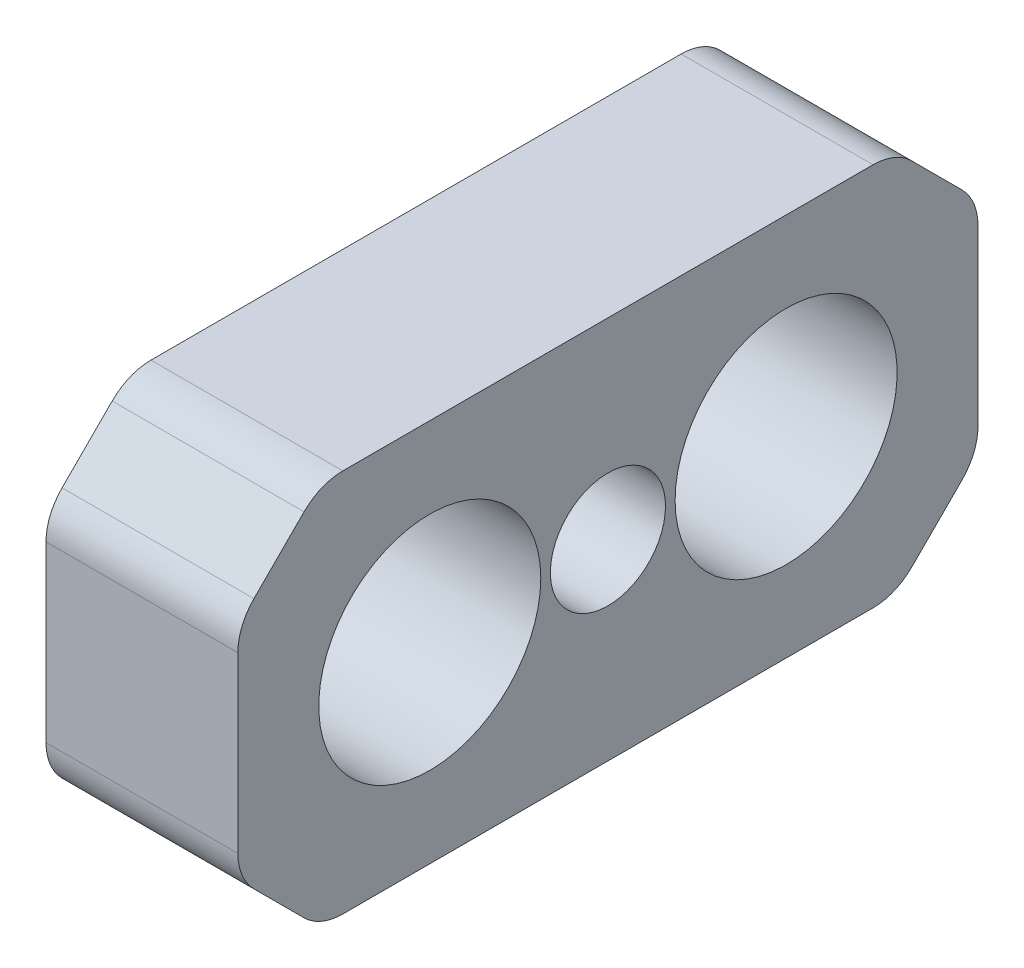
ISO-10303-21;
HEADER;
FILE_DESCRIPTION(('STEP AP214'),'2;1');
FILE_NAME('part.step','',(''),(''),'','','');
FILE_SCHEMA(('AUTOMOTIVE_DESIGN { 1 0 10303 214 1 1 1 1 }'));
ENDSEC;
DATA;
#1=APPLICATION_CONTEXT('core data for automotive mechanical design processes');
#2=APPLICATION_PROTOCOL_DEFINITION('international standard','automotive_design',2000,#1);
#3=PRODUCT_CONTEXT('',#1,'mechanical');
#4=PRODUCT('Part','Part','',(#3));
#5=PRODUCT_RELATED_PRODUCT_CATEGORY('part','',(#4));
#6=PRODUCT_DEFINITION_FORMATION('','',#4);
#7=PRODUCT_DEFINITION_CONTEXT('part definition',#1,'design');
#8=PRODUCT_DEFINITION('design','',#6,#7);
#9=PRODUCT_DEFINITION_SHAPE('','',#8);
#10=(LENGTH_UNIT() NAMED_UNIT(*) SI_UNIT(.MILLI.,.METRE.));
#11=(NAMED_UNIT(*) PLANE_ANGLE_UNIT() SI_UNIT($,.RADIAN.));
#12=(NAMED_UNIT(*) SI_UNIT($,.STERADIAN.) SOLID_ANGLE_UNIT());
#13=UNCERTAINTY_MEASURE_WITH_UNIT(LENGTH_MEASURE(1.E-05),#10,'distance_accuracy_value','');
#14=(GEOMETRIC_REPRESENTATION_CONTEXT(3) GLOBAL_UNCERTAINTY_ASSIGNED_CONTEXT((#13)) GLOBAL_UNIT_ASSIGNED_CONTEXT((#10,
#11,#12)) REPRESENTATION_CONTEXT('',''));
#15=CARTESIAN_POINT('',(0.,0.,0.));
#16=DIRECTION('',(0.,0.,1.));
#17=DIRECTION('',(1.,0.,0.));
#18=AXIS2_PLACEMENT_3D('',#15,#16,#17);
#19=CARTESIAN_POINT('',(7.,7.,13.5));
#20=DIRECTION('',(1.,0.,0.));
#21=DIRECTION('',(0.,0.,-1.));
#22=AXIS2_PLACEMENT_3D('',#19,#20,#21);
#23=PLANE('',#22);
#24=CARTESIAN_POINT('',(7.,0.,0.));
#25=DIRECTION('',(1.,0.,0.));
#26=DIRECTION('',(0.,0.,-1.));
#27=AXIS2_PLACEMENT_3D('',#24,#25,#26);
#28=CIRCLE('',#27,2.1);
#29=CARTESIAN_POINT('',(7.,0.,-2.1));
#30=VERTEX_POINT('',#29);
#31=EDGE_CURVE('E314',#30,#30,#28,.T.);
#32=ORIENTED_EDGE('',*,*,#31,.F.);
#33=EDGE_LOOP('',(#32));
#34=FACE_BOUND('',#33,.T.);
#35=CARTESIAN_POINT('',(7.,0.,6.5));
#36=DIRECTION('',(1.,0.,0.));
#37=DIRECTION('',(0.,0.,-1.));
#38=AXIS2_PLACEMENT_3D('',#35,#36,#37);
#39=CIRCLE('',#38,4.05);
#40=CARTESIAN_POINT('',(7.,0.,2.45));
#41=VERTEX_POINT('',#40);
#42=EDGE_CURVE('E272',#41,#41,#39,.T.);
#43=ORIENTED_EDGE('',*,*,#42,.F.);
#44=EDGE_LOOP('',(#43));
#45=FACE_BOUND('',#44,.T.);
#46=DIRECTION('',(0.,1.,0.));
#47=VECTOR('',#46,1.);
#48=CARTESIAN_POINT('',(7.,-7.,-13.5));
#49=LINE('',#48,#47);
#50=CARTESIAN_POINT('',(7.,-3.17157287525381,-13.5));
#51=VERTEX_POINT('',#50);
#52=CARTESIAN_POINT('',(7.,3.17157287525381,-13.5));
#53=VERTEX_POINT('',#52);
#54=EDGE_CURVE('E149',#51,#53,#49,.T.);
#55=ORIENTED_EDGE('',*,*,#54,.T.);
#56=CARTESIAN_POINT('',(7.,3.17157287525381,-11.5));
#57=DIRECTION('',(1.,0.,0.));
#58=DIRECTION('',(0.,0.,-1.));
#59=AXIS2_PLACEMENT_3D('',#56,#57,#58);
#60=CIRCLE('',#59,2.);
#61=CARTESIAN_POINT('',(7.,4.58578643762689,-12.9142135623731));
#62=VERTEX_POINT('',#61);
#63=EDGE_CURVE('E190',#53,#62,#60,.T.);
#64=ORIENTED_EDGE('',*,*,#63,.T.);
#65=DIRECTION('',(0.,-0.707106781186549,-0.707106781186546));
#66=VECTOR('',#65,1.);
#67=CARTESIAN_POINT('',(7.,19.,1.49999999999995));
#68=LINE('',#67,#66);
#69=CARTESIAN_POINT('',(7.,6.41421356237309,-11.0857864376269));
#70=VERTEX_POINT('',#69);
#71=EDGE_CURVE('E250',#62,#70,#68,.F.);
#72=ORIENTED_EDGE('',*,*,#71,.T.);
#73=CARTESIAN_POINT('',(7.,5.,-9.67157287525381));
#74=DIRECTION('',(1.,0.,0.));
#75=DIRECTION('',(0.,0.,-1.));
#76=AXIS2_PLACEMENT_3D('',#73,#74,#75);
#77=CIRCLE('',#76,2.);
#78=CARTESIAN_POINT('',(7.,7.,-9.67157287525381));
#79=VERTEX_POINT('',#78);
#80=EDGE_CURVE('E155',#70,#79,#77,.T.);
#81=ORIENTED_EDGE('',*,*,#80,.T.);
#82=DIRECTION('',(0.,0.,1.));
#83=VECTOR('',#82,1.);
#84=CARTESIAN_POINT('',(7.,7.,-13.5));
#85=LINE('',#84,#83);
#86=CARTESIAN_POINT('',(7.,7.,9.6715728752538));
#87=VERTEX_POINT('',#86);
#88=EDGE_CURVE('E167',#79,#87,#85,.T.);
#89=ORIENTED_EDGE('',*,*,#88,.T.);
#90=CARTESIAN_POINT('',(7.,5.,9.6715728752538));
#91=DIRECTION('',(1.,0.,0.));
#92=DIRECTION('',(0.,0.,-1.));
#93=AXIS2_PLACEMENT_3D('',#90,#91,#92);
#94=CIRCLE('',#93,2.);
#95=CARTESIAN_POINT('',(7.,6.41421356237309,11.0857864376269));
#96=VERTEX_POINT('',#95);
#97=EDGE_CURVE('E174',#87,#96,#94,.T.);
#98=ORIENTED_EDGE('',*,*,#97,.T.);
#99=DIRECTION('',(0.,0.707106781186546,-0.707106781186549));
#100=VECTOR('',#99,1.);
#101=CARTESIAN_POINT('',(7.,5.49999999999999,12.));
#102=LINE('',#101,#100);
#103=CARTESIAN_POINT('',(7.,4.5857864376269,12.9142135623731));
#104=VERTEX_POINT('',#103);
#105=EDGE_CURVE('E172',#96,#104,#102,.F.);
#106=ORIENTED_EDGE('',*,*,#105,.T.);
#107=CARTESIAN_POINT('',(7.,3.17157287525381,11.5));
#108=DIRECTION('',(1.,0.,0.));
#109=DIRECTION('',(0.,0.,-1.));
#110=AXIS2_PLACEMENT_3D('',#107,#108,#109);
#111=CIRCLE('',#110,2.);
#112=CARTESIAN_POINT('',(7.,3.17157287525381,13.5));
#113=VERTEX_POINT('',#112);
#114=EDGE_CURVE('E182',#104,#113,#111,.T.);
#115=ORIENTED_EDGE('',*,*,#114,.T.);
#116=DIRECTION('',(0.,-1.,0.));
#117=VECTOR('',#116,1.);
#118=CARTESIAN_POINT('',(7.,-7.,13.5));
#119=LINE('',#118,#117);
#120=CARTESIAN_POINT('',(7.,-3.17157287525381,13.5));
#121=VERTEX_POINT('',#120);
#122=EDGE_CURVE('E277',#113,#121,#119,.T.);
#123=ORIENTED_EDGE('',*,*,#122,.T.);
#124=CARTESIAN_POINT('',(7.,-3.17157287525381,11.5));
#125=DIRECTION('',(1.,0.,0.));
#126=DIRECTION('',(0.,0.,-1.));
#127=AXIS2_PLACEMENT_3D('',#124,#125,#126);
#128=CIRCLE('',#127,2.);
#129=CARTESIAN_POINT('',(7.,-4.58578643762691,12.9142135623731));
#130=VERTEX_POINT('',#129);
#131=EDGE_CURVE('E184',#121,#130,#128,.T.);
#132=ORIENTED_EDGE('',*,*,#131,.T.);
#133=DIRECTION('',(0.,0.707106781186549,0.707106781186546));
#134=VECTOR('',#133,1.);
#135=CARTESIAN_POINT('',(7.,1.50000000000002,19.));
#136=LINE('',#135,#134);
#137=CARTESIAN_POINT('',(7.,-6.41421356237309,11.0857864376269));
#138=VERTEX_POINT('',#137);
#139=EDGE_CURVE('E177',#130,#138,#136,.F.);
#140=ORIENTED_EDGE('',*,*,#139,.T.);
#141=CARTESIAN_POINT('',(7.,-5.,9.67157287525382));
#142=DIRECTION('',(1.,0.,0.));
#143=DIRECTION('',(0.,0.,-1.));
#144=AXIS2_PLACEMENT_3D('',#141,#142,#143);
#145=CIRCLE('',#144,2.);
#146=CARTESIAN_POINT('',(7.,-7.,9.67157287525382));
#147=VERTEX_POINT('',#146);
#148=EDGE_CURVE('E186',#138,#147,#145,.T.);
#149=ORIENTED_EDGE('',*,*,#148,.T.);
#150=DIRECTION('',(0.,0.,-1.));
#151=VECTOR('',#150,1.);
#152=CARTESIAN_POINT('',(7.,-7.,-13.5));
#153=LINE('',#152,#151);
#154=CARTESIAN_POINT('',(7.,-7.,-9.6715728752538));
#155=VERTEX_POINT('',#154);
#156=EDGE_CURVE('E168',#147,#155,#153,.T.);
#157=ORIENTED_EDGE('',*,*,#156,.T.);
#158=CARTESIAN_POINT('',(7.,-5.,-9.6715728752538));
#159=DIRECTION('',(1.,0.,0.));
#160=DIRECTION('',(0.,0.,-1.));
#161=AXIS2_PLACEMENT_3D('',#158,#159,#160);
#162=CIRCLE('',#161,2.);
#163=CARTESIAN_POINT('',(7.,-6.4142135623731,-11.0857864376269));
#164=VERTEX_POINT('',#163);
#165=EDGE_CURVE('E156',#155,#164,#162,.T.);
#166=ORIENTED_EDGE('',*,*,#165,.T.);
#167=DIRECTION('',(0.,-0.707106781186546,0.707106781186549));
#168=VECTOR('',#167,1.);
#169=CARTESIAN_POINT('',(7.,-12.,-5.49999999999995));
#170=LINE('',#169,#168);
#171=CARTESIAN_POINT('',(7.,-4.5857864376269,-12.9142135623731));
#172=VERTEX_POINT('',#171);
#173=EDGE_CURVE('E151',#164,#172,#170,.F.);
#174=ORIENTED_EDGE('',*,*,#173,.T.);
#175=CARTESIAN_POINT('',(7.,-3.17157287525381,-11.5));
#176=DIRECTION('',(1.,0.,0.));
#177=DIRECTION('',(0.,0.,-1.));
#178=AXIS2_PLACEMENT_3D('',#175,#176,#177);
#179=CIRCLE('',#178,2.);
#180=EDGE_CURVE('E146',#172,#51,#179,.T.);
#181=ORIENTED_EDGE('',*,*,#180,.T.);
#182=EDGE_LOOP('',(#55,#64,#72,#81,#89,#98,#106,#115,#123,#132,#140,#149,#157,#166,#174,#181));
#183=FACE_BOUND('',#182,.T.);
#184=CARTESIAN_POINT('',(7.,0.,-6.5));
#185=DIRECTION('',(1.,0.,0.));
#186=DIRECTION('',(0.,0.,1.));
#187=AXIS2_PLACEMENT_3D('',#184,#185,#186);
#188=CIRCLE('',#187,4.05);
#189=CARTESIAN_POINT('',(7.,0.,-2.45));
#190=VERTEX_POINT('',#189);
#191=EDGE_CURVE('E305',#190,#190,#188,.T.);
#192=ORIENTED_EDGE('',*,*,#191,.F.);
#193=EDGE_LOOP('',(#192));
#194=FACE_BOUND('',#193,.T.);
#195=ADVANCED_FACE('F32',(#34,#45,#183,#194),#23,.T.);
#196=CARTESIAN_POINT('',(0.,7.,13.5));
#197=DIRECTION('',(1.,0.,0.));
#198=DIRECTION('',(0.,0.,-1.));
#199=AXIS2_PLACEMENT_3D('',#196,#197,#198);
#200=PLANE('',#199);
#201=CARTESIAN_POINT('',(0.,0.,6.5));
#202=DIRECTION('',(1.,0.,0.));
#203=DIRECTION('',(0.,0.,-1.));
#204=AXIS2_PLACEMENT_3D('',#201,#202,#203);
#205=CIRCLE('',#204,4.05);
#206=CARTESIAN_POINT('',(0.,0.,2.45));
#207=VERTEX_POINT('',#206);
#208=EDGE_CURVE('E302',#207,#207,#205,.T.);
#209=ORIENTED_EDGE('',*,*,#208,.T.);
#210=EDGE_LOOP('',(#209));
#211=FACE_BOUND('',#210,.T.);
#212=DIRECTION('',(0.,0.707106781186549,0.707106781186546));
#213=VECTOR('',#212,1.);
#214=CARTESIAN_POINT('',(0.,7.,-10.5));
#215=LINE('',#214,#213);
#216=CARTESIAN_POINT('',(0.,6.41421356237309,-11.0857864376269));
#217=VERTEX_POINT('',#216);
#218=CARTESIAN_POINT('',(0.,4.5857864376269,-12.9142135623731));
#219=VERTEX_POINT('',#218);
#220=EDGE_CURVE('E262',#217,#219,#215,.F.);
#221=ORIENTED_EDGE('',*,*,#220,.T.);
#222=CARTESIAN_POINT('',(0.,3.17157287525381,-11.5));
#223=DIRECTION('',(1.,0.,0.));
#224=DIRECTION('',(0.,0.,-1.));
#225=AXIS2_PLACEMENT_3D('',#222,#223,#224);
#226=CIRCLE('',#225,2.);
#227=CARTESIAN_POINT('',(0.,3.17157287525381,-13.5));
#228=VERTEX_POINT('',#227);
#229=EDGE_CURVE('E208',#219,#228,#226,.F.);
#230=ORIENTED_EDGE('',*,*,#229,.T.);
#231=DIRECTION('',(0.,1.,0.));
#232=VECTOR('',#231,1.);
#233=CARTESIAN_POINT('',(0.,-7.,-13.5));
#234=LINE('',#233,#232);
#235=CARTESIAN_POINT('',(0.,-3.17157287525381,-13.5));
#236=VERTEX_POINT('',#235);
#237=EDGE_CURVE('E275',#236,#228,#234,.T.);
#238=ORIENTED_EDGE('',*,*,#237,.F.);
#239=CARTESIAN_POINT('',(0.,-3.17157287525381,-11.5));
#240=DIRECTION('',(1.,0.,0.));
#241=DIRECTION('',(0.,0.,-1.));
#242=AXIS2_PLACEMENT_3D('',#239,#240,#241);
#243=CIRCLE('',#242,2.);
#244=CARTESIAN_POINT('',(0.,-4.5857864376269,-12.9142135623731));
#245=VERTEX_POINT('',#244);
#246=EDGE_CURVE('E171',#236,#245,#243,.F.);
#247=ORIENTED_EDGE('',*,*,#246,.T.);
#248=DIRECTION('',(0.,0.707106781186546,-0.707106781186549));
#249=VECTOR('',#248,1.);
#250=CARTESIAN_POINT('',(0.,-4.,-13.5));
#251=LINE('',#250,#249);
#252=CARTESIAN_POINT('',(0.,-6.4142135623731,-11.0857864376269));
#253=VERTEX_POINT('',#252);
#254=EDGE_CURVE('E264',#245,#253,#251,.F.);
#255=ORIENTED_EDGE('',*,*,#254,.T.);
#256=CARTESIAN_POINT('',(0.,-5.,-9.6715728752538));
#257=DIRECTION('',(1.,0.,0.));
#258=DIRECTION('',(0.,0.,-1.));
#259=AXIS2_PLACEMENT_3D('',#256,#257,#258);
#260=CIRCLE('',#259,2.);
#261=CARTESIAN_POINT('',(0.,-7.,-9.6715728752538));
#262=VERTEX_POINT('',#261);
#263=EDGE_CURVE('E203',#253,#262,#260,.F.);
#264=ORIENTED_EDGE('',*,*,#263,.T.);
#265=DIRECTION('',(0.,0.,-1.));
#266=VECTOR('',#265,1.);
#267=CARTESIAN_POINT('',(0.,-7.,-13.5));
#268=LINE('',#267,#266);
#269=CARTESIAN_POINT('',(0.,-7.,9.67157287525382));
#270=VERTEX_POINT('',#269);
#271=EDGE_CURVE('E271',#270,#262,#268,.T.);
#272=ORIENTED_EDGE('',*,*,#271,.F.);
#273=CARTESIAN_POINT('',(0.,-5.,9.67157287525382));
#274=DIRECTION('',(1.,0.,0.));
#275=DIRECTION('',(0.,0.,-1.));
#276=AXIS2_PLACEMENT_3D('',#273,#274,#275);
#277=CIRCLE('',#276,2.);
#278=CARTESIAN_POINT('',(0.,-6.41421356237309,11.0857864376269));
#279=VERTEX_POINT('',#278);
#280=EDGE_CURVE('E54',#270,#279,#277,.F.);
#281=ORIENTED_EDGE('',*,*,#280,.T.);
#282=DIRECTION('',(0.,-0.707106781186549,-0.707106781186546));
#283=VECTOR('',#282,1.);
#284=CARTESIAN_POINT('',(0.,-7.,10.5));
#285=LINE('',#284,#283);
#286=CARTESIAN_POINT('',(0.,-4.5857864376269,12.9142135623731));
#287=VERTEX_POINT('',#286);
#288=EDGE_CURVE('E251',#279,#287,#285,.F.);
#289=ORIENTED_EDGE('',*,*,#288,.T.);
#290=CARTESIAN_POINT('',(0.,-3.17157287525381,11.5));
#291=DIRECTION('',(1.,0.,0.));
#292=DIRECTION('',(0.,0.,-1.));
#293=AXIS2_PLACEMENT_3D('',#290,#291,#292);
#294=CIRCLE('',#293,2.);
#295=CARTESIAN_POINT('',(0.,-3.17157287525381,13.5));
#296=VERTEX_POINT('',#295);
#297=EDGE_CURVE('E200',#287,#296,#294,.F.);
#298=ORIENTED_EDGE('',*,*,#297,.T.);
#299=DIRECTION('',(0.,-1.,0.));
#300=VECTOR('',#299,1.);
#301=CARTESIAN_POINT('',(0.,-7.,13.5));
#302=LINE('',#301,#300);
#303=CARTESIAN_POINT('',(0.,3.17157287525381,13.5));
#304=VERTEX_POINT('',#303);
#305=EDGE_CURVE('E268',#304,#296,#302,.T.);
#306=ORIENTED_EDGE('',*,*,#305,.F.);
#307=CARTESIAN_POINT('',(0.,3.17157287525381,11.5));
#308=DIRECTION('',(1.,0.,0.));
#309=DIRECTION('',(0.,0.,-1.));
#310=AXIS2_PLACEMENT_3D('',#307,#308,#309);
#311=CIRCLE('',#310,2.);
#312=CARTESIAN_POINT('',(0.,4.5857864376269,12.9142135623731));
#313=VERTEX_POINT('',#312);
#314=EDGE_CURVE('E198',#304,#313,#311,.F.);
#315=ORIENTED_EDGE('',*,*,#314,.T.);
#316=DIRECTION('',(0.,-0.707106781186546,0.707106781186549));
#317=VECTOR('',#316,1.);
#318=CARTESIAN_POINT('',(0.,4.,13.5));
#319=LINE('',#318,#317);
#320=CARTESIAN_POINT('',(0.,6.41421356237309,11.0857864376269));
#321=VERTEX_POINT('',#320);
#322=EDGE_CURVE('E240',#313,#321,#319,.F.);
#323=ORIENTED_EDGE('',*,*,#322,.T.);
#324=CARTESIAN_POINT('',(0.,5.,9.6715728752538));
#325=DIRECTION('',(1.,0.,0.));
#326=DIRECTION('',(0.,0.,-1.));
#327=AXIS2_PLACEMENT_3D('',#324,#325,#326);
#328=CIRCLE('',#327,2.);
#329=CARTESIAN_POINT('',(0.,7.,9.6715728752538));
#330=VERTEX_POINT('',#329);
#331=EDGE_CURVE('E196',#321,#330,#328,.F.);
#332=ORIENTED_EDGE('',*,*,#331,.T.);
#333=DIRECTION('',(0.,0.,1.));
#334=VECTOR('',#333,1.);
#335=CARTESIAN_POINT('',(0.,7.,-13.5));
#336=LINE('',#335,#334);
#337=CARTESIAN_POINT('',(0.,7.,-9.67157287525381));
#338=VERTEX_POINT('',#337);
#339=EDGE_CURVE('E259',#338,#330,#336,.T.);
#340=ORIENTED_EDGE('',*,*,#339,.F.);
#341=CARTESIAN_POINT('',(0.,5.,-9.67157287525381));
#342=DIRECTION('',(1.,0.,0.));
#343=DIRECTION('',(0.,0.,-1.));
#344=AXIS2_PLACEMENT_3D('',#341,#342,#343);
#345=CIRCLE('',#344,2.);
#346=EDGE_CURVE('E206',#338,#217,#345,.F.);
#347=ORIENTED_EDGE('',*,*,#346,.T.);
#348=EDGE_LOOP('',(#221,#230,#238,#247,#255,#264,#272,#281,#289,#298,#306,#315,#323,#332,#340,#347));
#349=FACE_BOUND('',#348,.T.);
#350=CARTESIAN_POINT('',(0.,0.,-6.5));
#351=DIRECTION('',(1.,0.,0.));
#352=DIRECTION('',(0.,0.,1.));
#353=AXIS2_PLACEMENT_3D('',#350,#351,#352);
#354=CIRCLE('',#353,4.05);
#355=CARTESIAN_POINT('',(0.,0.,-2.45));
#356=VERTEX_POINT('',#355);
#357=EDGE_CURVE('E308',#356,#356,#354,.T.);
#358=ORIENTED_EDGE('',*,*,#357,.T.);
#359=EDGE_LOOP('',(#358));
#360=FACE_BOUND('',#359,.T.);
#361=ADVANCED_FACE('F245',(#211,#349,#360),#200,.F.);
#362=CARTESIAN_POINT('',(7.,-7.,13.5));
#363=DIRECTION('',(0.,0.,-1.));
#364=DIRECTION('',(-1.,0.,0.));
#365=AXIS2_PLACEMENT_3D('',#362,#363,#364);
#366=PLANE('',#365);
#367=ORIENTED_EDGE('',*,*,#305,.T.);
#368=DIRECTION('',(-1.,0.,0.));
#369=VECTOR('',#368,1.);
#370=CARTESIAN_POINT('',(7.,-3.17157287525381,13.5));
#371=LINE('',#370,#369);
#372=EDGE_CURVE('E232',#296,#121,#371,.F.);
#373=ORIENTED_EDGE('',*,*,#372,.T.);
#374=ORIENTED_EDGE('',*,*,#122,.F.);
#375=DIRECTION('',(1.,0.,0.));
#376=VECTOR('',#375,1.);
#377=CARTESIAN_POINT('',(0.,3.17157287525381,13.5));
#378=LINE('',#377,#376);
#379=EDGE_CURVE('E229',#113,#304,#378,.F.);
#380=ORIENTED_EDGE('',*,*,#379,.T.);
#381=EDGE_LOOP('',(#367,#373,#374,#380));
#382=FACE_BOUND('',#381,.T.);
#383=ADVANCED_FACE('F341',(#382),#366,.F.);
#384=CARTESIAN_POINT('',(7.,-7.,-13.5));
#385=DIRECTION('',(0.,1.,0.));
#386=DIRECTION('',(0.,0.,1.));
#387=AXIS2_PLACEMENT_3D('',#384,#385,#386);
#388=PLANE('',#387);
#389=ORIENTED_EDGE('',*,*,#271,.T.);
#390=DIRECTION('',(-1.,0.,0.));
#391=VECTOR('',#390,1.);
#392=CARTESIAN_POINT('',(7.,-7.,-9.6715728752538));
#393=LINE('',#392,#391);
#394=EDGE_CURVE('E223',#262,#155,#393,.F.);
#395=ORIENTED_EDGE('',*,*,#394,.T.);
#396=ORIENTED_EDGE('',*,*,#156,.F.);
#397=DIRECTION('',(1.,0.,0.));
#398=VECTOR('',#397,1.);
#399=CARTESIAN_POINT('',(0.,-7.,9.67157287525382));
#400=LINE('',#399,#398);
#401=EDGE_CURVE('E220',#147,#270,#400,.F.);
#402=ORIENTED_EDGE('',*,*,#401,.T.);
#403=EDGE_LOOP('',(#389,#395,#396,#402));
#404=FACE_BOUND('',#403,.T.);
#405=ADVANCED_FACE('F293',(#404),#388,.F.);
#406=CARTESIAN_POINT('',(7.,-7.,-13.5));
#407=DIRECTION('',(0.,0.,1.));
#408=DIRECTION('',(1.,0.,0.));
#409=AXIS2_PLACEMENT_3D('',#406,#407,#408);
#410=PLANE('',#409);
#411=ORIENTED_EDGE('',*,*,#237,.T.);
#412=DIRECTION('',(-1.,0.,0.));
#413=VECTOR('',#412,1.);
#414=CARTESIAN_POINT('',(7.,3.17157287525381,-13.5));
#415=LINE('',#414,#413);
#416=EDGE_CURVE('E166',#228,#53,#415,.F.);
#417=ORIENTED_EDGE('',*,*,#416,.T.);
#418=ORIENTED_EDGE('',*,*,#54,.F.);
#419=DIRECTION('',(1.,0.,0.));
#420=VECTOR('',#419,1.);
#421=CARTESIAN_POINT('',(0.,-3.17157287525381,-13.5));
#422=LINE('',#421,#420);
#423=EDGE_CURVE('E163',#51,#236,#422,.F.);
#424=ORIENTED_EDGE('',*,*,#423,.T.);
#425=EDGE_LOOP('',(#411,#417,#418,#424));
#426=FACE_BOUND('',#425,.T.);
#427=ADVANCED_FACE('F162',(#426),#410,.F.);
#428=CARTESIAN_POINT('',(7.,7.,-13.5));
#429=DIRECTION('',(0.,-1.,0.));
#430=DIRECTION('',(0.,0.,-1.));
#431=AXIS2_PLACEMENT_3D('',#428,#429,#430);
#432=PLANE('',#431);
#433=ORIENTED_EDGE('',*,*,#88,.F.);
#434=DIRECTION('',(1.,0.,0.));
#435=VECTOR('',#434,1.);
#436=CARTESIAN_POINT('',(0.,7.,-9.67157287525381));
#437=LINE('',#436,#435);
#438=EDGE_CURVE('E213',#79,#338,#437,.F.);
#439=ORIENTED_EDGE('',*,*,#438,.T.);
#440=ORIENTED_EDGE('',*,*,#339,.T.);
#441=DIRECTION('',(-1.,0.,0.));
#442=VECTOR('',#441,1.);
#443=CARTESIAN_POINT('',(7.,7.,9.6715728752538));
#444=LINE('',#443,#442);
#445=EDGE_CURVE('E210',#330,#87,#444,.F.);
#446=ORIENTED_EDGE('',*,*,#445,.T.);
#447=EDGE_LOOP('',(#433,#439,#440,#446));
#448=FACE_BOUND('',#447,.T.);
#449=ADVANCED_FACE('F257',(#448),#432,.F.);
#450=CARTESIAN_POINT('',(7.,0.,6.5));
#451=DIRECTION('',(-1.,0.,0.));
#452=DIRECTION('',(0.,0.,1.));
#453=AXIS2_PLACEMENT_3D('',#450,#451,#452);
#454=CYLINDRICAL_SURFACE('',#453,4.05);
#455=ORIENTED_EDGE('',*,*,#42,.T.);
#456=EDGE_LOOP('',(#455));
#457=FACE_BOUND('',#456,.T.);
#458=ORIENTED_EDGE('',*,*,#208,.F.);
#459=EDGE_LOOP('',(#458));
#460=FACE_BOUND('',#459,.T.);
#461=ADVANCED_FACE('F334',(#457,#460),#454,.F.);
#462=CARTESIAN_POINT('',(7.,0.,-6.5));
#463=DIRECTION('',(-1.,0.,0.));
#464=DIRECTION('',(0.,0.,1.));
#465=AXIS2_PLACEMENT_3D('',#462,#463,#464);
#466=CYLINDRICAL_SURFACE('',#465,4.05);
#467=ORIENTED_EDGE('',*,*,#191,.T.);
#468=EDGE_LOOP('',(#467));
#469=FACE_BOUND('',#468,.T.);
#470=ORIENTED_EDGE('',*,*,#357,.F.);
#471=EDGE_LOOP('',(#470));
#472=FACE_BOUND('',#471,.T.);
#473=ADVANCED_FACE('F325',(#469,#472),#466,.F.);
#474=CARTESIAN_POINT('',(2.,0.,0.));
#475=DIRECTION('',(1.,0.,0.));
#476=DIRECTION('',(0.,0.,-1.));
#477=AXIS2_PLACEMENT_3D('',#474,#475,#476);
#478=CYLINDRICAL_SURFACE('',#477,2.1);
#479=CARTESIAN_POINT('',(2.,0.,0.));
#480=DIRECTION('',(1.,0.,0.));
#481=DIRECTION('',(0.,0.,-1.));
#482=AXIS2_PLACEMENT_3D('',#479,#480,#481);
#483=CIRCLE('',#482,2.1);
#484=CARTESIAN_POINT('',(2.,0.,-2.1));
#485=VERTEX_POINT('',#484);
#486=EDGE_CURVE('E311',#485,#485,#483,.T.);
#487=ORIENTED_EDGE('',*,*,#486,.F.);
#488=EDGE_LOOP('',(#487));
#489=FACE_BOUND('',#488,.T.);
#490=ORIENTED_EDGE('',*,*,#31,.T.);
#491=EDGE_LOOP('',(#490));
#492=FACE_BOUND('',#491,.T.);
#493=ADVANCED_FACE('F322',(#489,#492),#478,.F.);
#494=CARTESIAN_POINT('',(2.,0.,0.));
#495=DIRECTION('',(1.,0.,0.));
#496=DIRECTION('',(0.,0.,-1.));
#497=AXIS2_PLACEMENT_3D('',#494,#495,#496);
#498=PLANE('',#497);
#499=ORIENTED_EDGE('',*,*,#486,.T.);
#500=EDGE_LOOP('',(#499));
#501=FACE_BOUND('',#500,.T.);
#502=ADVANCED_FACE('F320',(#501),#498,.T.);
#503=CARTESIAN_POINT('',(7.,4.,13.5));
#504=DIRECTION('',(0.,-0.707106781186549,-0.707106781186546));
#505=DIRECTION('',(-1.,0.,0.));
#506=AXIS2_PLACEMENT_3D('',#503,#504,#505);
#507=PLANE('',#506);
#508=ORIENTED_EDGE('',*,*,#322,.F.);
#509=DIRECTION('',(-1.,0.,0.));
#510=VECTOR('',#509,1.);
#511=CARTESIAN_POINT('',(7.,4.5857864376269,12.9142135623731));
#512=LINE('',#511,#510);
#513=EDGE_CURVE('E11',#313,#104,#512,.F.);
#514=ORIENTED_EDGE('',*,*,#513,.T.);
#515=ORIENTED_EDGE('',*,*,#105,.F.);
#516=DIRECTION('',(1.,0.,0.));
#517=VECTOR('',#516,1.);
#518=CARTESIAN_POINT('',(0.,6.41421356237309,11.0857864376269));
#519=LINE('',#518,#517);
#520=EDGE_CURVE('E40',#96,#321,#519,.F.);
#521=ORIENTED_EDGE('',*,*,#520,.T.);
#522=EDGE_LOOP('',(#508,#514,#515,#521));
#523=FACE_BOUND('',#522,.T.);
#524=ADVANCED_FACE('F239',(#523),#507,.F.);
#525=CARTESIAN_POINT('',(7.,-7.,10.5));
#526=DIRECTION('',(0.,0.707106781186546,-0.707106781186549));
#527=DIRECTION('',(-1.,0.,0.));
#528=AXIS2_PLACEMENT_3D('',#525,#526,#527);
#529=PLANE('',#528);
#530=ORIENTED_EDGE('',*,*,#288,.F.);
#531=DIRECTION('',(-1.,0.,0.));
#532=VECTOR('',#531,1.);
#533=CARTESIAN_POINT('',(7.,-6.41421356237309,11.0857864376269));
#534=LINE('',#533,#532);
#535=EDGE_CURVE('E227',#279,#138,#534,.F.);
#536=ORIENTED_EDGE('',*,*,#535,.T.);
#537=ORIENTED_EDGE('',*,*,#139,.F.);
#538=DIRECTION('',(1.,0.,0.));
#539=VECTOR('',#538,1.);
#540=CARTESIAN_POINT('',(0.,-4.5857864376269,12.9142135623731));
#541=LINE('',#540,#539);
#542=EDGE_CURVE('E47',#130,#287,#541,.F.);
#543=ORIENTED_EDGE('',*,*,#542,.T.);
#544=EDGE_LOOP('',(#530,#536,#537,#543));
#545=FACE_BOUND('',#544,.T.);
#546=ADVANCED_FACE('F357',(#545),#529,.F.);
#547=CARTESIAN_POINT('',(7.,-4.,-13.5));
#548=DIRECTION('',(0.,0.707106781186549,0.707106781186546));
#549=DIRECTION('',(-1.,0.,0.));
#550=AXIS2_PLACEMENT_3D('',#547,#548,#549);
#551=PLANE('',#550);
#552=ORIENTED_EDGE('',*,*,#254,.F.);
#553=DIRECTION('',(-1.,0.,0.));
#554=VECTOR('',#553,1.);
#555=CARTESIAN_POINT('',(7.,-4.5857864376269,-12.9142135623731));
#556=LINE('',#555,#554);
#557=EDGE_CURVE('E218',#245,#172,#556,.F.);
#558=ORIENTED_EDGE('',*,*,#557,.T.);
#559=ORIENTED_EDGE('',*,*,#173,.F.);
#560=DIRECTION('',(1.,0.,0.));
#561=VECTOR('',#560,1.);
#562=CARTESIAN_POINT('',(0.,-6.4142135623731,-11.0857864376269));
#563=LINE('',#562,#561);
#564=EDGE_CURVE('E216',#164,#253,#563,.F.);
#565=ORIENTED_EDGE('',*,*,#564,.T.);
#566=EDGE_LOOP('',(#552,#558,#559,#565));
#567=FACE_BOUND('',#566,.T.);
#568=ADVANCED_FACE('F360',(#567),#551,.F.);
#569=CARTESIAN_POINT('',(7.,7.,-10.5));
#570=DIRECTION('',(0.,-0.707106781186546,0.707106781186549));
#571=DIRECTION('',(-1.,0.,0.));
#572=AXIS2_PLACEMENT_3D('',#569,#570,#571);
#573=PLANE('',#572);
#574=ORIENTED_EDGE('',*,*,#71,.F.);
#575=DIRECTION('',(1.,0.,0.));
#576=VECTOR('',#575,1.);
#577=CARTESIAN_POINT('',(0.,4.5857864376269,-12.9142135623731));
#578=LINE('',#577,#576);
#579=EDGE_CURVE('E194',#62,#219,#578,.F.);
#580=ORIENTED_EDGE('',*,*,#579,.T.);
#581=ORIENTED_EDGE('',*,*,#220,.F.);
#582=DIRECTION('',(-1.,0.,0.));
#583=VECTOR('',#582,1.);
#584=CARTESIAN_POINT('',(7.,6.41421356237309,-11.0857864376269));
#585=LINE('',#584,#583);
#586=EDGE_CURVE('E192',#217,#70,#585,.F.);
#587=ORIENTED_EDGE('',*,*,#586,.T.);
#588=EDGE_LOOP('',(#574,#580,#581,#587));
#589=FACE_BOUND('',#588,.T.);
#590=ADVANCED_FACE('F363',(#589),#573,.F.);
#591=CARTESIAN_POINT('',(7.,3.17157287525381,-11.5));
#592=DIRECTION('',(1.,0.,0.));
#593=DIRECTION('',(0.,0.,-1.));
#594=AXIS2_PLACEMENT_3D('',#591,#592,#593);
#595=CYLINDRICAL_SURFACE('',#594,2.);
#596=ORIENTED_EDGE('',*,*,#229,.F.);
#597=ORIENTED_EDGE('',*,*,#579,.F.);
#598=ORIENTED_EDGE('',*,*,#63,.F.);
#599=ORIENTED_EDGE('',*,*,#416,.F.);
#600=EDGE_LOOP('',(#596,#597,#598,#599));
#601=FACE_BOUND('',#600,.T.);
#602=ADVANCED_FACE('F367',(#601),#595,.T.);
#603=CARTESIAN_POINT('',(7.,5.,-9.67157287525381));
#604=DIRECTION('',(-1.,0.,0.));
#605=DIRECTION('',(0.,0.,1.));
#606=AXIS2_PLACEMENT_3D('',#603,#604,#605);
#607=CYLINDRICAL_SURFACE('',#606,2.);
#608=ORIENTED_EDGE('',*,*,#80,.F.);
#609=ORIENTED_EDGE('',*,*,#586,.F.);
#610=ORIENTED_EDGE('',*,*,#346,.F.);
#611=ORIENTED_EDGE('',*,*,#438,.F.);
#612=EDGE_LOOP('',(#608,#609,#610,#611));
#613=FACE_BOUND('',#612,.T.);
#614=ADVANCED_FACE('F371',(#613),#607,.T.);
#615=CARTESIAN_POINT('',(7.,-3.17157287525381,-11.5));
#616=DIRECTION('',(-1.,0.,0.));
#617=DIRECTION('',(0.,0.,1.));
#618=AXIS2_PLACEMENT_3D('',#615,#616,#617);
#619=CYLINDRICAL_SURFACE('',#618,2.);
#620=ORIENTED_EDGE('',*,*,#180,.F.);
#621=ORIENTED_EDGE('',*,*,#557,.F.);
#622=ORIENTED_EDGE('',*,*,#246,.F.);
#623=ORIENTED_EDGE('',*,*,#423,.F.);
#624=EDGE_LOOP('',(#620,#621,#622,#623));
#625=FACE_BOUND('',#624,.T.);
#626=ADVANCED_FACE('F170',(#625),#619,.T.);
#627=CARTESIAN_POINT('',(7.,-5.,-9.6715728752538));
#628=DIRECTION('',(1.,0.,0.));
#629=DIRECTION('',(0.,0.,-1.));
#630=AXIS2_PLACEMENT_3D('',#627,#628,#629);
#631=CYLINDRICAL_SURFACE('',#630,2.);
#632=ORIENTED_EDGE('',*,*,#263,.F.);
#633=ORIENTED_EDGE('',*,*,#564,.F.);
#634=ORIENTED_EDGE('',*,*,#165,.F.);
#635=ORIENTED_EDGE('',*,*,#394,.F.);
#636=EDGE_LOOP('',(#632,#633,#634,#635));
#637=FACE_BOUND('',#636,.T.);
#638=ADVANCED_FACE('F299',(#637),#631,.T.);
#639=CARTESIAN_POINT('',(7.,-5.,9.67157287525382));
#640=DIRECTION('',(-1.,0.,0.));
#641=DIRECTION('',(0.,0.,1.));
#642=AXIS2_PLACEMENT_3D('',#639,#640,#641);
#643=CYLINDRICAL_SURFACE('',#642,2.);
#644=ORIENTED_EDGE('',*,*,#148,.F.);
#645=ORIENTED_EDGE('',*,*,#535,.F.);
#646=ORIENTED_EDGE('',*,*,#280,.F.);
#647=ORIENTED_EDGE('',*,*,#401,.F.);
#648=EDGE_LOOP('',(#644,#645,#646,#647));
#649=FACE_BOUND('',#648,.T.);
#650=ADVANCED_FACE('F291',(#649),#643,.T.);
#651=CARTESIAN_POINT('',(7.,-3.17157287525381,11.5));
#652=DIRECTION('',(1.,0.,0.));
#653=DIRECTION('',(0.,0.,-1.));
#654=AXIS2_PLACEMENT_3D('',#651,#652,#653);
#655=CYLINDRICAL_SURFACE('',#654,2.);
#656=ORIENTED_EDGE('',*,*,#297,.F.);
#657=ORIENTED_EDGE('',*,*,#542,.F.);
#658=ORIENTED_EDGE('',*,*,#131,.F.);
#659=ORIENTED_EDGE('',*,*,#372,.F.);
#660=EDGE_LOOP('',(#656,#657,#658,#659));
#661=FACE_BOUND('',#660,.T.);
#662=ADVANCED_FACE('F382',(#661),#655,.T.);
#663=CARTESIAN_POINT('',(7.,3.17157287525381,11.5));
#664=DIRECTION('',(-1.,0.,0.));
#665=DIRECTION('',(0.,0.,1.));
#666=AXIS2_PLACEMENT_3D('',#663,#664,#665);
#667=CYLINDRICAL_SURFACE('',#666,2.);
#668=ORIENTED_EDGE('',*,*,#114,.F.);
#669=ORIENTED_EDGE('',*,*,#513,.F.);
#670=ORIENTED_EDGE('',*,*,#314,.F.);
#671=ORIENTED_EDGE('',*,*,#379,.F.);
#672=EDGE_LOOP('',(#668,#669,#670,#671));
#673=FACE_BOUND('',#672,.T.);
#674=ADVANCED_FACE('F384',(#673),#667,.T.);
#675=CARTESIAN_POINT('',(7.,5.,9.6715728752538));
#676=DIRECTION('',(1.,0.,0.));
#677=DIRECTION('',(0.,0.,-1.));
#678=AXIS2_PLACEMENT_3D('',#675,#676,#677);
#679=CYLINDRICAL_SURFACE('',#678,2.);
#680=ORIENTED_EDGE('',*,*,#331,.F.);
#681=ORIENTED_EDGE('',*,*,#520,.F.);
#682=ORIENTED_EDGE('',*,*,#97,.F.);
#683=ORIENTED_EDGE('',*,*,#445,.F.);
#684=EDGE_LOOP('',(#680,#681,#682,#683));
#685=FACE_BOUND('',#684,.T.);
#686=ADVANCED_FACE('F34',(#685),#679,.T.);
#687=CLOSED_SHELL('',(#195,#361,#383,#405,#427,#449,#461,#473,#493,#502,#524,#546,#568,#590,
#602,#614,#626,#638,#650,#662,#674,#686));
#688=MANIFOLD_SOLID_BREP('B2',#687);
#689=ADVANCED_BREP_SHAPE_REPRESENTATION('',(#18,#688),#14);
#690=SHAPE_DEFINITION_REPRESENTATION(#9,#689);
ENDSEC;
END-ISO-10303-21;
